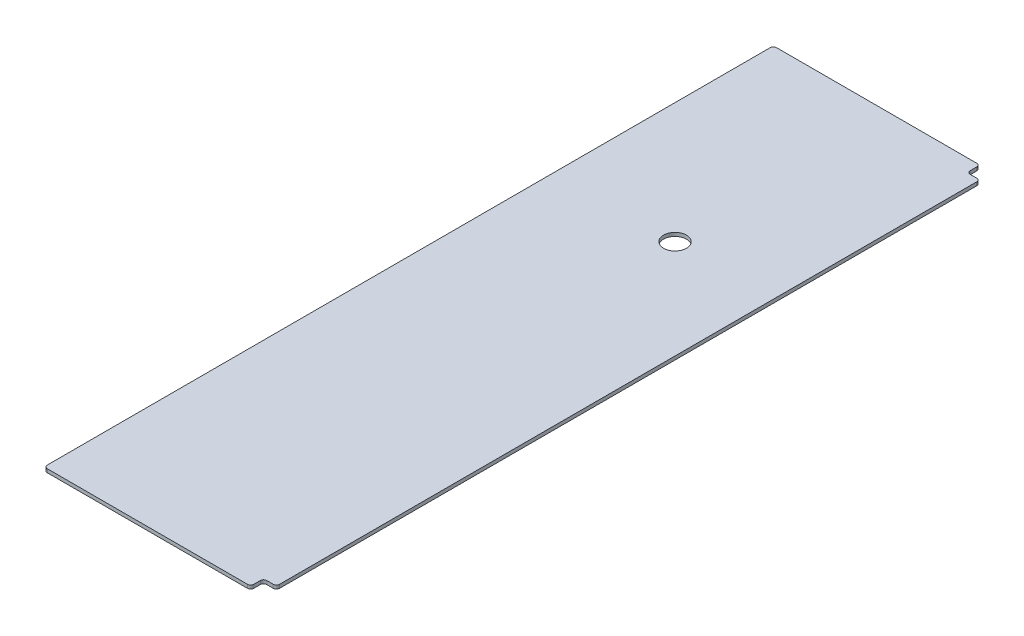
ISO-10303-21;
HEADER;
FILE_DESCRIPTION(('STEP AP214'),'2;1');
FILE_NAME('part.step','',(''),(''),'','','');
FILE_SCHEMA(('AUTOMOTIVE_DESIGN { 1 0 10303 214 1 1 1 1 }'));
ENDSEC;
DATA;
#1=APPLICATION_CONTEXT('core data for automotive mechanical design processes');
#2=APPLICATION_PROTOCOL_DEFINITION('international standard','automotive_design',2000,#1);
#3=PRODUCT_CONTEXT('',#1,'mechanical');
#4=PRODUCT('Part','Part','',(#3));
#5=PRODUCT_RELATED_PRODUCT_CATEGORY('part','',(#4));
#6=PRODUCT_DEFINITION_FORMATION('','',#4);
#7=PRODUCT_DEFINITION_CONTEXT('part definition',#1,'design');
#8=PRODUCT_DEFINITION('design','',#6,#7);
#9=PRODUCT_DEFINITION_SHAPE('','',#8);
#10=(LENGTH_UNIT() NAMED_UNIT(*) SI_UNIT(.MILLI.,.METRE.));
#11=(NAMED_UNIT(*) PLANE_ANGLE_UNIT() SI_UNIT($,.RADIAN.));
#12=(NAMED_UNIT(*) SI_UNIT($,.STERADIAN.) SOLID_ANGLE_UNIT());
#13=UNCERTAINTY_MEASURE_WITH_UNIT(LENGTH_MEASURE(1.E-05),#10,'distance_accuracy_value','');
#14=(GEOMETRIC_REPRESENTATION_CONTEXT(3) GLOBAL_UNCERTAINTY_ASSIGNED_CONTEXT((#13)) GLOBAL_UNIT_ASSIGNED_CONTEXT((#10,
#11,#12)) REPRESENTATION_CONTEXT('',''));
#15=CARTESIAN_POINT('',(0.,0.,0.));
#16=DIRECTION('',(0.,0.,1.));
#17=DIRECTION('',(1.,0.,0.));
#18=AXIS2_PLACEMENT_3D('',#15,#16,#17);
#19=CARTESIAN_POINT('',(190.5,2.778125,0.));
#20=DIRECTION('',(-1.,0.,0.));
#21=DIRECTION('',(0.,0.,1.));
#22=AXIS2_PLACEMENT_3D('',#19,#20,#21);
#23=PLANE('',#22);
#24=DIRECTION('',(0.,0.,-1.));
#25=VECTOR('',#24,1.);
#26=CARTESIAN_POINT('',(190.5,2.778125,0.));
#27=LINE('',#26,#25);
#28=CARTESIAN_POINT('',(190.5,2.778125,-30.48));
#29=VERTEX_POINT('',#28);
#30=CARTESIAN_POINT('',(190.5,2.778125,-579.12));
#31=VERTEX_POINT('',#30);
#32=EDGE_CURVE('E182',#29,#31,#27,.T.);
#33=ORIENTED_EDGE('',*,*,#32,.F.);
#34=DIRECTION('',(0.,1.,0.));
#35=VECTOR('',#34,1.);
#36=CARTESIAN_POINT('',(190.5,2.778125,-30.48));
#37=LINE('',#36,#35);
#38=CARTESIAN_POINT('',(190.5,0.,-30.48));
#39=VERTEX_POINT('',#38);
#40=EDGE_CURVE('E238',#29,#39,#37,.F.);
#41=ORIENTED_EDGE('',*,*,#40,.T.);
#42=DIRECTION('',(0.,0.,-1.));
#43=VECTOR('',#42,1.);
#44=CARTESIAN_POINT('',(190.5,0.,0.));
#45=LINE('',#44,#43);
#46=CARTESIAN_POINT('',(190.5,0.,-579.12));
#47=VERTEX_POINT('',#46);
#48=EDGE_CURVE('E185',#39,#47,#45,.T.);
#49=ORIENTED_EDGE('',*,*,#48,.T.);
#50=DIRECTION('',(0.,1.,0.));
#51=VECTOR('',#50,1.);
#52=CARTESIAN_POINT('',(190.5,2.778125,-579.12));
#53=LINE('',#52,#51);
#54=EDGE_CURVE('E235',#47,#31,#53,.T.);
#55=ORIENTED_EDGE('',*,*,#54,.T.);
#56=EDGE_LOOP('',(#33,#41,#49,#55));
#57=FACE_BOUND('',#56,.T.);
#58=ADVANCED_FACE('F33',(#57),#23,.F.);
#59=CARTESIAN_POINT('',(0.,2.778125,0.));
#60=DIRECTION('',(0.,-1.,0.));
#61=DIRECTION('',(0.,0.,-1.));
#62=AXIS2_PLACEMENT_3D('',#59,#60,#61);
#63=PLANE('',#62);
#64=CARTESIAN_POINT('',(112.580000000002,2.778125,-419.599999966549));
#65=DIRECTION('',(0.,-1.,0.));
#66=DIRECTION('',(0.,0.,-1.));
#67=AXIS2_PLACEMENT_3D('',#64,#65,#66);
#68=CIRCLE('',#67,9.00000000000002);
#69=CARTESIAN_POINT('',(112.580000000002,2.778125,-428.599999966549));
#70=VERTEX_POINT('',#69);
#71=EDGE_CURVE('E279',#70,#70,#68,.T.);
#72=ORIENTED_EDGE('',*,*,#71,.T.);
#73=EDGE_LOOP('',(#72));
#74=FACE_BOUND('',#73,.T.);
#75=DIRECTION('',(1.,0.,0.));
#76=VECTOR('',#75,1.);
#77=CARTESIAN_POINT('',(0.,2.778125,-591.82));
#78=LINE('',#77,#76);
#79=CARTESIAN_POINT('',(20.32,2.778125,-591.82));
#80=VERTEX_POINT('',#79);
#81=CARTESIAN_POINT('',(177.8,2.778125,-591.82));
#82=VERTEX_POINT('',#81);
#83=EDGE_CURVE('E164',#80,#82,#78,.T.);
#84=ORIENTED_EDGE('',*,*,#83,.F.);
#85=CARTESIAN_POINT('',(20.32,2.778125,-589.28));
#86=DIRECTION('',(0.,-1.,0.));
#87=DIRECTION('',(0.,0.,-1.));
#88=AXIS2_PLACEMENT_3D('',#85,#86,#87);
#89=CIRCLE('',#88,2.54);
#90=CARTESIAN_POINT('',(17.78,2.778125,-589.28));
#91=VERTEX_POINT('',#90);
#92=EDGE_CURVE('E147',#80,#91,#89,.F.);
#93=ORIENTED_EDGE('',*,*,#92,.T.);
#94=DIRECTION('',(0.,0.,-1.));
#95=VECTOR('',#94,1.);
#96=CARTESIAN_POINT('',(17.78,2.778125,-591.82));
#97=LINE('',#96,#95);
#98=CARTESIAN_POINT('',(17.78,2.778125,-20.32));
#99=VERTEX_POINT('',#98);
#100=EDGE_CURVE('E178',#99,#91,#97,.T.);
#101=ORIENTED_EDGE('',*,*,#100,.F.);
#102=CARTESIAN_POINT('',(20.32,2.778125,-20.32));
#103=DIRECTION('',(0.,-1.,0.));
#104=DIRECTION('',(0.,0.,-1.));
#105=AXIS2_PLACEMENT_3D('',#102,#103,#104);
#106=CIRCLE('',#105,2.54);
#107=CARTESIAN_POINT('',(20.32,2.778125,-17.78));
#108=VERTEX_POINT('',#107);
#109=EDGE_CURVE('E158',#99,#108,#106,.F.);
#110=ORIENTED_EDGE('',*,*,#109,.T.);
#111=DIRECTION('',(-1.,0.,0.));
#112=VECTOR('',#111,1.);
#113=CARTESIAN_POINT('',(0.,2.778125,-17.78));
#114=LINE('',#113,#112);
#115=CARTESIAN_POINT('',(177.8,2.778125,-17.78));
#116=VERTEX_POINT('',#115);
#117=EDGE_CURVE('E175',#116,#108,#114,.T.);
#118=ORIENTED_EDGE('',*,*,#117,.F.);
#119=CARTESIAN_POINT('',(177.8,2.778125,-20.32));
#120=DIRECTION('',(0.,-1.,0.));
#121=DIRECTION('',(0.,0.,-1.));
#122=AXIS2_PLACEMENT_3D('',#119,#120,#121);
#123=CIRCLE('',#122,2.54);
#124=CARTESIAN_POINT('',(180.34,2.778125,-20.32));
#125=VERTEX_POINT('',#124);
#126=EDGE_CURVE('E192',#116,#125,#123,.F.);
#127=ORIENTED_EDGE('',*,*,#126,.T.);
#128=DIRECTION('',(0.,0.,1.));
#129=VECTOR('',#128,1.);
#130=CARTESIAN_POINT('',(180.34,2.778125,-17.78));
#131=LINE('',#130,#129);
#132=CARTESIAN_POINT('',(180.34,2.778125,-25.4));
#133=VERTEX_POINT('',#132);
#134=EDGE_CURVE('E273',#133,#125,#131,.T.);
#135=ORIENTED_EDGE('',*,*,#134,.F.);
#136=CARTESIAN_POINT('',(182.88,2.778125,-25.4));
#137=DIRECTION('',(0.,-1.,0.));
#138=DIRECTION('',(0.,0.,-1.));
#139=AXIS2_PLACEMENT_3D('',#136,#137,#138);
#140=CIRCLE('',#139,2.54);
#141=CARTESIAN_POINT('',(182.88,2.778125,-27.94));
#142=VERTEX_POINT('',#141);
#143=EDGE_CURVE('E240',#133,#142,#140,.T.);
#144=ORIENTED_EDGE('',*,*,#143,.T.);
#145=DIRECTION('',(-1.,0.,0.));
#146=VECTOR('',#145,1.);
#147=CARTESIAN_POINT('',(190.5,2.778125,-27.94));
#148=LINE('',#147,#146);
#149=CARTESIAN_POINT('',(187.96,2.778125,-27.94));
#150=VERTEX_POINT('',#149);
#151=EDGE_CURVE('E276',#150,#142,#148,.T.);
#152=ORIENTED_EDGE('',*,*,#151,.F.);
#153=CARTESIAN_POINT('',(187.96,2.778125,-30.48));
#154=DIRECTION('',(0.,-1.,0.));
#155=DIRECTION('',(0.,0.,-1.));
#156=AXIS2_PLACEMENT_3D('',#153,#154,#155);
#157=CIRCLE('',#156,2.54);
#158=EDGE_CURVE('E194',#150,#29,#157,.F.);
#159=ORIENTED_EDGE('',*,*,#158,.T.);
#160=ORIENTED_EDGE('',*,*,#32,.T.);
#161=CARTESIAN_POINT('',(187.96,2.778125,-579.12));
#162=DIRECTION('',(0.,-1.,0.));
#163=DIRECTION('',(0.,0.,-1.));
#164=AXIS2_PLACEMENT_3D('',#161,#162,#163);
#165=CIRCLE('',#164,2.54);
#166=CARTESIAN_POINT('',(187.96,2.778125,-581.66));
#167=VERTEX_POINT('',#166);
#168=EDGE_CURVE('E167',#31,#167,#165,.F.);
#169=ORIENTED_EDGE('',*,*,#168,.T.);
#170=DIRECTION('',(1.,0.,0.));
#171=VECTOR('',#170,1.);
#172=CARTESIAN_POINT('',(190.5,2.778125,-581.66));
#173=LINE('',#172,#171);
#174=CARTESIAN_POINT('',(182.88,2.778125,-581.66));
#175=VERTEX_POINT('',#174);
#176=EDGE_CURVE('E246',#175,#167,#173,.T.);
#177=ORIENTED_EDGE('',*,*,#176,.F.);
#178=CARTESIAN_POINT('',(182.88,2.778125,-584.2));
#179=DIRECTION('',(0.,-1.,0.));
#180=DIRECTION('',(0.,0.,-1.));
#181=AXIS2_PLACEMENT_3D('',#178,#179,#180);
#182=CIRCLE('',#181,2.54);
#183=CARTESIAN_POINT('',(180.34,2.778125,-584.2));
#184=VERTEX_POINT('',#183);
#185=EDGE_CURVE('E41',#175,#184,#182,.T.);
#186=ORIENTED_EDGE('',*,*,#185,.T.);
#187=DIRECTION('',(0.,0.,1.));
#188=VECTOR('',#187,1.);
#189=CARTESIAN_POINT('',(180.34,2.778125,-591.82));
#190=LINE('',#189,#188);
#191=CARTESIAN_POINT('',(180.34,2.778125,-589.28));
#192=VERTEX_POINT('',#191);
#193=EDGE_CURVE('E244',#192,#184,#190,.T.);
#194=ORIENTED_EDGE('',*,*,#193,.F.);
#195=CARTESIAN_POINT('',(177.8,2.778125,-589.28));
#196=DIRECTION('',(0.,-1.,0.));
#197=DIRECTION('',(0.,0.,-1.));
#198=AXIS2_PLACEMENT_3D('',#195,#196,#197);
#199=CIRCLE('',#198,2.54);
#200=EDGE_CURVE('E172',#192,#82,#199,.F.);
#201=ORIENTED_EDGE('',*,*,#200,.T.);
#202=EDGE_LOOP('',(#84,#93,#101,#110,#118,#127,#135,#144,#152,#159,#160,#169,#177,#186,#194,#201));
#203=FACE_BOUND('',#202,.T.);
#204=ADVANCED_FACE('F170',(#74,#203),#63,.F.);
#205=CARTESIAN_POINT('',(0.,0.,0.));
#206=DIRECTION('',(0.,-1.,0.));
#207=DIRECTION('',(0.,0.,-1.));
#208=AXIS2_PLACEMENT_3D('',#205,#206,#207);
#209=PLANE('',#208);
#210=CARTESIAN_POINT('',(112.580000000002,0.,-419.599999966549));
#211=DIRECTION('',(0.,-1.,0.));
#212=DIRECTION('',(0.,0.,-1.));
#213=AXIS2_PLACEMENT_3D('',#210,#211,#212);
#214=CIRCLE('',#213,9.00000000000002);
#215=CARTESIAN_POINT('',(112.580000000002,0.,-428.599999966549));
#216=VERTEX_POINT('',#215);
#217=EDGE_CURVE('E482',#216,#216,#214,.T.);
#218=ORIENTED_EDGE('',*,*,#217,.F.);
#219=EDGE_LOOP('',(#218));
#220=FACE_BOUND('',#219,.T.);
#221=DIRECTION('',(0.,0.,-1.));
#222=VECTOR('',#221,1.);
#223=CARTESIAN_POINT('',(17.78,0.,-591.82));
#224=LINE('',#223,#222);
#225=CARTESIAN_POINT('',(17.78,0.,-20.32));
#226=VERTEX_POINT('',#225);
#227=CARTESIAN_POINT('',(17.78,0.,-589.28));
#228=VERTEX_POINT('',#227);
#229=EDGE_CURVE('E173',#226,#228,#224,.T.);
#230=ORIENTED_EDGE('',*,*,#229,.T.);
#231=CARTESIAN_POINT('',(20.32,0.,-589.28));
#232=DIRECTION('',(0.,-1.,0.));
#233=DIRECTION('',(0.,0.,-1.));
#234=AXIS2_PLACEMENT_3D('',#231,#232,#233);
#235=CIRCLE('',#234,2.54);
#236=CARTESIAN_POINT('',(20.32,0.,-591.82));
#237=VERTEX_POINT('',#236);
#238=EDGE_CURVE('E209',#228,#237,#235,.T.);
#239=ORIENTED_EDGE('',*,*,#238,.T.);
#240=DIRECTION('',(1.,0.,0.));
#241=VECTOR('',#240,1.);
#242=CARTESIAN_POINT('',(0.,0.,-591.82));
#243=LINE('',#242,#241);
#244=CARTESIAN_POINT('',(177.8,0.,-591.82));
#245=VERTEX_POINT('',#244);
#246=EDGE_CURVE('E166',#237,#245,#243,.T.);
#247=ORIENTED_EDGE('',*,*,#246,.T.);
#248=CARTESIAN_POINT('',(177.8,0.,-589.28));
#249=DIRECTION('',(0.,-1.,0.));
#250=DIRECTION('',(0.,0.,-1.));
#251=AXIS2_PLACEMENT_3D('',#248,#249,#250);
#252=CIRCLE('',#251,2.54);
#253=CARTESIAN_POINT('',(180.34,0.,-589.28));
#254=VERTEX_POINT('',#253);
#255=EDGE_CURVE('E55',#245,#254,#252,.T.);
#256=ORIENTED_EDGE('',*,*,#255,.T.);
#257=DIRECTION('',(0.,0.,1.));
#258=VECTOR('',#257,1.);
#259=CARTESIAN_POINT('',(180.34,0.,-591.82));
#260=LINE('',#259,#258);
#261=CARTESIAN_POINT('',(180.34,0.,-584.2));
#262=VERTEX_POINT('',#261);
#263=EDGE_CURVE('E260',#254,#262,#260,.T.);
#264=ORIENTED_EDGE('',*,*,#263,.T.);
#265=CARTESIAN_POINT('',(182.88,0.,-584.2));
#266=DIRECTION('',(0.,-1.,0.));
#267=DIRECTION('',(0.,0.,-1.));
#268=AXIS2_PLACEMENT_3D('',#265,#266,#267);
#269=CIRCLE('',#268,2.54);
#270=CARTESIAN_POINT('',(182.88,0.,-581.66));
#271=VERTEX_POINT('',#270);
#272=EDGE_CURVE('E11',#262,#271,#269,.F.);
#273=ORIENTED_EDGE('',*,*,#272,.T.);
#274=DIRECTION('',(1.,0.,0.));
#275=VECTOR('',#274,1.);
#276=CARTESIAN_POINT('',(190.5,0.,-581.66));
#277=LINE('',#276,#275);
#278=CARTESIAN_POINT('',(187.96,0.,-581.66));
#279=VERTEX_POINT('',#278);
#280=EDGE_CURVE('E258',#271,#279,#277,.T.);
#281=ORIENTED_EDGE('',*,*,#280,.T.);
#282=CARTESIAN_POINT('',(187.96,0.,-579.12));
#283=DIRECTION('',(0.,-1.,0.));
#284=DIRECTION('',(0.,0.,-1.));
#285=AXIS2_PLACEMENT_3D('',#282,#283,#284);
#286=CIRCLE('',#285,2.54);
#287=EDGE_CURVE('E200',#279,#47,#286,.T.);
#288=ORIENTED_EDGE('',*,*,#287,.T.);
#289=ORIENTED_EDGE('',*,*,#48,.F.);
#290=CARTESIAN_POINT('',(187.96,0.,-30.48));
#291=DIRECTION('',(0.,-1.,0.));
#292=DIRECTION('',(0.,0.,-1.));
#293=AXIS2_PLACEMENT_3D('',#290,#291,#292);
#294=CIRCLE('',#293,2.54);
#295=CARTESIAN_POINT('',(187.96,0.,-27.94));
#296=VERTEX_POINT('',#295);
#297=EDGE_CURVE('E205',#39,#296,#294,.T.);
#298=ORIENTED_EDGE('',*,*,#297,.T.);
#299=DIRECTION('',(-1.,0.,0.));
#300=VECTOR('',#299,1.);
#301=CARTESIAN_POINT('',(190.5,0.,-27.94));
#302=LINE('',#301,#300);
#303=CARTESIAN_POINT('',(182.88,0.,-27.94));
#304=VERTEX_POINT('',#303);
#305=EDGE_CURVE('E270',#296,#304,#302,.T.);
#306=ORIENTED_EDGE('',*,*,#305,.T.);
#307=CARTESIAN_POINT('',(182.88,0.,-25.4));
#308=DIRECTION('',(0.,-1.,0.));
#309=DIRECTION('',(0.,0.,-1.));
#310=AXIS2_PLACEMENT_3D('',#307,#308,#309);
#311=CIRCLE('',#310,2.54);
#312=CARTESIAN_POINT('',(180.34,0.,-25.4));
#313=VERTEX_POINT('',#312);
#314=EDGE_CURVE('E242',#304,#313,#311,.F.);
#315=ORIENTED_EDGE('',*,*,#314,.T.);
#316=DIRECTION('',(0.,0.,1.));
#317=VECTOR('',#316,1.);
#318=CARTESIAN_POINT('',(180.34,0.,-17.78));
#319=LINE('',#318,#317);
#320=CARTESIAN_POINT('',(180.34,0.,-20.32));
#321=VERTEX_POINT('',#320);
#322=EDGE_CURVE('E251',#313,#321,#319,.T.);
#323=ORIENTED_EDGE('',*,*,#322,.T.);
#324=CARTESIAN_POINT('',(177.8,0.,-20.32));
#325=DIRECTION('',(0.,-1.,0.));
#326=DIRECTION('',(0.,0.,-1.));
#327=AXIS2_PLACEMENT_3D('',#324,#325,#326);
#328=CIRCLE('',#327,2.54);
#329=CARTESIAN_POINT('',(177.8,0.,-17.78));
#330=VERTEX_POINT('',#329);
#331=EDGE_CURVE('E203',#321,#330,#328,.T.);
#332=ORIENTED_EDGE('',*,*,#331,.T.);
#333=DIRECTION('',(-1.,0.,0.));
#334=VECTOR('',#333,1.);
#335=CARTESIAN_POINT('',(0.,0.,-17.78));
#336=LINE('',#335,#334);
#337=CARTESIAN_POINT('',(20.32,0.,-17.78));
#338=VERTEX_POINT('',#337);
#339=EDGE_CURVE('E188',#330,#338,#336,.T.);
#340=ORIENTED_EDGE('',*,*,#339,.T.);
#341=CARTESIAN_POINT('',(20.32,0.,-20.32));
#342=DIRECTION('',(0.,-1.,0.));
#343=DIRECTION('',(0.,0.,-1.));
#344=AXIS2_PLACEMENT_3D('',#341,#342,#343);
#345=CIRCLE('',#344,2.54);
#346=EDGE_CURVE('E207',#338,#226,#345,.T.);
#347=ORIENTED_EDGE('',*,*,#346,.T.);
#348=EDGE_LOOP('',(#230,#239,#247,#256,#264,#273,#281,#288,#289,#298,#306,#315,#323,#332,#340,#347));
#349=FACE_BOUND('',#348,.T.);
#350=ADVANCED_FACE('F257',(#220,#349),#209,.T.);
#351=CARTESIAN_POINT('',(0.,0.,-591.82));
#352=DIRECTION('',(0.,0.,1.));
#353=DIRECTION('',(1.,0.,0.));
#354=AXIS2_PLACEMENT_3D('',#351,#352,#353);
#355=PLANE('',#354);
#356=ORIENTED_EDGE('',*,*,#246,.F.);
#357=DIRECTION('',(0.,1.,0.));
#358=VECTOR('',#357,1.);
#359=CARTESIAN_POINT('',(20.32,0.,-591.82));
#360=LINE('',#359,#358);
#361=EDGE_CURVE('E151',#237,#80,#360,.T.);
#362=ORIENTED_EDGE('',*,*,#361,.T.);
#363=ORIENTED_EDGE('',*,*,#83,.T.);
#364=DIRECTION('',(0.,1.,0.));
#365=VECTOR('',#364,1.);
#366=CARTESIAN_POINT('',(177.8,0.,-591.82));
#367=LINE('',#366,#365);
#368=EDGE_CURVE('E168',#82,#245,#367,.F.);
#369=ORIENTED_EDGE('',*,*,#368,.T.);
#370=EDGE_LOOP('',(#356,#362,#363,#369));
#371=FACE_BOUND('',#370,.T.);
#372=ADVANCED_FACE('F163',(#371),#355,.F.);
#373=CARTESIAN_POINT('',(0.,0.,-17.78));
#374=DIRECTION('',(0.,0.,-1.));
#375=DIRECTION('',(-1.,0.,0.));
#376=AXIS2_PLACEMENT_3D('',#373,#374,#375);
#377=PLANE('',#376);
#378=ORIENTED_EDGE('',*,*,#117,.T.);
#379=DIRECTION('',(0.,1.,0.));
#380=VECTOR('',#379,1.);
#381=CARTESIAN_POINT('',(20.32,0.,-17.78));
#382=LINE('',#381,#380);
#383=EDGE_CURVE('E214',#108,#338,#382,.F.);
#384=ORIENTED_EDGE('',*,*,#383,.T.);
#385=ORIENTED_EDGE('',*,*,#339,.F.);
#386=DIRECTION('',(0.,1.,0.));
#387=VECTOR('',#386,1.);
#388=CARTESIAN_POINT('',(177.8,0.,-17.78));
#389=LINE('',#388,#387);
#390=EDGE_CURVE('E211',#330,#116,#389,.T.);
#391=ORIENTED_EDGE('',*,*,#390,.T.);
#392=EDGE_LOOP('',(#378,#384,#385,#391));
#393=FACE_BOUND('',#392,.T.);
#394=ADVANCED_FACE('F287',(#393),#377,.F.);
#395=CARTESIAN_POINT('',(17.78,0.,-591.82));
#396=DIRECTION('',(1.,0.,0.));
#397=DIRECTION('',(0.,0.,-1.));
#398=AXIS2_PLACEMENT_3D('',#395,#396,#397);
#399=PLANE('',#398);
#400=ORIENTED_EDGE('',*,*,#100,.T.);
#401=DIRECTION('',(0.,1.,0.));
#402=VECTOR('',#401,1.);
#403=CARTESIAN_POINT('',(17.78,0.,-589.28));
#404=LINE('',#403,#402);
#405=EDGE_CURVE('E152',#91,#228,#404,.F.);
#406=ORIENTED_EDGE('',*,*,#405,.T.);
#407=ORIENTED_EDGE('',*,*,#229,.F.);
#408=DIRECTION('',(0.,1.,0.));
#409=VECTOR('',#408,1.);
#410=CARTESIAN_POINT('',(17.78,0.,-20.32));
#411=LINE('',#410,#409);
#412=EDGE_CURVE('E157',#226,#99,#411,.T.);
#413=ORIENTED_EDGE('',*,*,#412,.T.);
#414=EDGE_LOOP('',(#400,#406,#407,#413));
#415=FACE_BOUND('',#414,.T.);
#416=ADVANCED_FACE('F296',(#415),#399,.F.);
#417=CARTESIAN_POINT('',(180.34,0.,-17.78));
#418=DIRECTION('',(-1.,0.,0.));
#419=DIRECTION('',(0.,0.,1.));
#420=AXIS2_PLACEMENT_3D('',#417,#418,#419);
#421=PLANE('',#420);
#422=ORIENTED_EDGE('',*,*,#322,.F.);
#423=DIRECTION('',(0.,1.,0.));
#424=VECTOR('',#423,1.);
#425=CARTESIAN_POINT('',(180.34,2.778125,-25.4));
#426=LINE('',#425,#424);
#427=EDGE_CURVE('E218',#313,#133,#426,.T.);
#428=ORIENTED_EDGE('',*,*,#427,.T.);
#429=ORIENTED_EDGE('',*,*,#134,.T.);
#430=DIRECTION('',(0.,1.,0.));
#431=VECTOR('',#430,1.);
#432=CARTESIAN_POINT('',(180.34,0.,-20.32));
#433=LINE('',#432,#431);
#434=EDGE_CURVE('E216',#125,#321,#433,.F.);
#435=ORIENTED_EDGE('',*,*,#434,.T.);
#436=EDGE_LOOP('',(#422,#428,#429,#435));
#437=FACE_BOUND('',#436,.T.);
#438=ADVANCED_FACE('F298',(#437),#421,.F.);
#439=CARTESIAN_POINT('',(190.5,0.,-27.94));
#440=DIRECTION('',(0.,0.,-1.));
#441=DIRECTION('',(-1.,0.,0.));
#442=AXIS2_PLACEMENT_3D('',#439,#440,#441);
#443=PLANE('',#442);
#444=ORIENTED_EDGE('',*,*,#151,.T.);
#445=DIRECTION('',(0.,1.,0.));
#446=VECTOR('',#445,1.);
#447=CARTESIAN_POINT('',(182.88,0.,-27.94));
#448=LINE('',#447,#446);
#449=EDGE_CURVE('E224',#142,#304,#448,.F.);
#450=ORIENTED_EDGE('',*,*,#449,.T.);
#451=ORIENTED_EDGE('',*,*,#305,.F.);
#452=DIRECTION('',(0.,1.,0.));
#453=VECTOR('',#452,1.);
#454=CARTESIAN_POINT('',(187.96,0.,-27.94));
#455=LINE('',#454,#453);
#456=EDGE_CURVE('E221',#296,#150,#455,.T.);
#457=ORIENTED_EDGE('',*,*,#456,.T.);
#458=EDGE_LOOP('',(#444,#450,#451,#457));
#459=FACE_BOUND('',#458,.T.);
#460=ADVANCED_FACE('F304',(#459),#443,.F.);
#461=CARTESIAN_POINT('',(190.5,0.,-581.66));
#462=DIRECTION('',(0.,0.,1.));
#463=DIRECTION('',(1.,0.,0.));
#464=AXIS2_PLACEMENT_3D('',#461,#462,#463);
#465=PLANE('',#464);
#466=ORIENTED_EDGE('',*,*,#280,.F.);
#467=DIRECTION('',(0.,1.,0.));
#468=VECTOR('',#467,1.);
#469=CARTESIAN_POINT('',(182.88,2.778125,-581.66));
#470=LINE('',#469,#468);
#471=EDGE_CURVE('E228',#271,#175,#470,.T.);
#472=ORIENTED_EDGE('',*,*,#471,.T.);
#473=ORIENTED_EDGE('',*,*,#176,.T.);
#474=DIRECTION('',(0.,1.,0.));
#475=VECTOR('',#474,1.);
#476=CARTESIAN_POINT('',(187.96,0.,-581.66));
#477=LINE('',#476,#475);
#478=EDGE_CURVE('E226',#167,#279,#477,.F.);
#479=ORIENTED_EDGE('',*,*,#478,.T.);
#480=EDGE_LOOP('',(#466,#472,#473,#479));
#481=FACE_BOUND('',#480,.T.);
#482=ADVANCED_FACE('F262',(#481),#465,.F.);
#483=CARTESIAN_POINT('',(180.34,0.,-591.82));
#484=DIRECTION('',(-1.,0.,0.));
#485=DIRECTION('',(0.,0.,1.));
#486=AXIS2_PLACEMENT_3D('',#483,#484,#485);
#487=PLANE('',#486);
#488=ORIENTED_EDGE('',*,*,#193,.T.);
#489=DIRECTION('',(0.,1.,0.));
#490=VECTOR('',#489,1.);
#491=CARTESIAN_POINT('',(180.34,0.,-584.2));
#492=LINE('',#491,#490);
#493=EDGE_CURVE('E48',#184,#262,#492,.F.);
#494=ORIENTED_EDGE('',*,*,#493,.T.);
#495=ORIENTED_EDGE('',*,*,#263,.F.);
#496=DIRECTION('',(0.,1.,0.));
#497=VECTOR('',#496,1.);
#498=CARTESIAN_POINT('',(180.34,0.,-589.28));
#499=LINE('',#498,#497);
#500=EDGE_CURVE('E231',#254,#192,#499,.T.);
#501=ORIENTED_EDGE('',*,*,#500,.T.);
#502=EDGE_LOOP('',(#488,#494,#495,#501));
#503=FACE_BOUND('',#502,.T.);
#504=ADVANCED_FACE('F249',(#503),#487,.F.);
#505=CARTESIAN_POINT('',(20.32,0.,-589.28));
#506=DIRECTION('',(0.,1.,0.));
#507=DIRECTION('',(0.,0.,1.));
#508=AXIS2_PLACEMENT_3D('',#505,#506,#507);
#509=CYLINDRICAL_SURFACE('',#508,2.54);
#510=ORIENTED_EDGE('',*,*,#238,.F.);
#511=ORIENTED_EDGE('',*,*,#405,.F.);
#512=ORIENTED_EDGE('',*,*,#92,.F.);
#513=ORIENTED_EDGE('',*,*,#361,.F.);
#514=EDGE_LOOP('',(#510,#511,#512,#513));
#515=FACE_BOUND('',#514,.T.);
#516=ADVANCED_FACE('F150',(#515),#509,.T.);
#517=CARTESIAN_POINT('',(20.32,0.,-20.32));
#518=DIRECTION('',(0.,1.,0.));
#519=DIRECTION('',(0.,0.,1.));
#520=AXIS2_PLACEMENT_3D('',#517,#518,#519);
#521=CYLINDRICAL_SURFACE('',#520,2.54);
#522=ORIENTED_EDGE('',*,*,#346,.F.);
#523=ORIENTED_EDGE('',*,*,#383,.F.);
#524=ORIENTED_EDGE('',*,*,#109,.F.);
#525=ORIENTED_EDGE('',*,*,#412,.F.);
#526=EDGE_LOOP('',(#522,#523,#524,#525));
#527=FACE_BOUND('',#526,.T.);
#528=ADVANCED_FACE('F292',(#527),#521,.T.);
#529=CARTESIAN_POINT('',(182.88,0.,-25.4));
#530=DIRECTION('',(0.,-1.,0.));
#531=DIRECTION('',(0.,0.,-1.));
#532=AXIS2_PLACEMENT_3D('',#529,#530,#531);
#533=CYLINDRICAL_SURFACE('',#532,2.54);
#534=ORIENTED_EDGE('',*,*,#314,.F.);
#535=ORIENTED_EDGE('',*,*,#449,.F.);
#536=ORIENTED_EDGE('',*,*,#143,.F.);
#537=ORIENTED_EDGE('',*,*,#427,.F.);
#538=EDGE_LOOP('',(#534,#535,#536,#537));
#539=FACE_BOUND('',#538,.T.);
#540=ADVANCED_FACE('F325',(#539),#533,.F.);
#541=CARTESIAN_POINT('',(182.88,0.,-584.2));
#542=DIRECTION('',(0.,-1.,0.));
#543=DIRECTION('',(0.,0.,-1.));
#544=AXIS2_PLACEMENT_3D('',#541,#542,#543);
#545=CYLINDRICAL_SURFACE('',#544,2.54);
#546=ORIENTED_EDGE('',*,*,#272,.F.);
#547=ORIENTED_EDGE('',*,*,#493,.F.);
#548=ORIENTED_EDGE('',*,*,#185,.F.);
#549=ORIENTED_EDGE('',*,*,#471,.F.);
#550=EDGE_LOOP('',(#546,#547,#548,#549));
#551=FACE_BOUND('',#550,.T.);
#552=ADVANCED_FACE('F254',(#551),#545,.F.);
#553=CARTESIAN_POINT('',(187.96,0.,-30.48));
#554=DIRECTION('',(0.,1.,0.));
#555=DIRECTION('',(0.,0.,1.));
#556=AXIS2_PLACEMENT_3D('',#553,#554,#555);
#557=CYLINDRICAL_SURFACE('',#556,2.54);
#558=ORIENTED_EDGE('',*,*,#297,.F.);
#559=ORIENTED_EDGE('',*,*,#40,.F.);
#560=ORIENTED_EDGE('',*,*,#158,.F.);
#561=ORIENTED_EDGE('',*,*,#456,.F.);
#562=EDGE_LOOP('',(#558,#559,#560,#561));
#563=FACE_BOUND('',#562,.T.);
#564=ADVANCED_FACE('F331',(#563),#557,.T.);
#565=CARTESIAN_POINT('',(177.8,0.,-20.32));
#566=DIRECTION('',(0.,1.,0.));
#567=DIRECTION('',(0.,0.,1.));
#568=AXIS2_PLACEMENT_3D('',#565,#566,#567);
#569=CYLINDRICAL_SURFACE('',#568,2.54);
#570=ORIENTED_EDGE('',*,*,#331,.F.);
#571=ORIENTED_EDGE('',*,*,#434,.F.);
#572=ORIENTED_EDGE('',*,*,#126,.F.);
#573=ORIENTED_EDGE('',*,*,#390,.F.);
#574=EDGE_LOOP('',(#570,#571,#572,#573));
#575=FACE_BOUND('',#574,.T.);
#576=ADVANCED_FACE('F334',(#575),#569,.T.);
#577=CARTESIAN_POINT('',(177.8,0.,-589.28));
#578=DIRECTION('',(0.,1.,0.));
#579=DIRECTION('',(0.,0.,1.));
#580=AXIS2_PLACEMENT_3D('',#577,#578,#579);
#581=CYLINDRICAL_SURFACE('',#580,2.54);
#582=ORIENTED_EDGE('',*,*,#255,.F.);
#583=ORIENTED_EDGE('',*,*,#368,.F.);
#584=ORIENTED_EDGE('',*,*,#200,.F.);
#585=ORIENTED_EDGE('',*,*,#500,.F.);
#586=EDGE_LOOP('',(#582,#583,#584,#585));
#587=FACE_BOUND('',#586,.T.);
#588=ADVANCED_FACE('F337',(#587),#581,.T.);
#589=CARTESIAN_POINT('',(187.96,2.778125,-579.12));
#590=DIRECTION('',(0.,1.,0.));
#591=DIRECTION('',(0.,0.,1.));
#592=AXIS2_PLACEMENT_3D('',#589,#590,#591);
#593=CYLINDRICAL_SURFACE('',#592,2.54);
#594=ORIENTED_EDGE('',*,*,#287,.F.);
#595=ORIENTED_EDGE('',*,*,#478,.F.);
#596=ORIENTED_EDGE('',*,*,#168,.F.);
#597=ORIENTED_EDGE('',*,*,#54,.F.);
#598=EDGE_LOOP('',(#594,#595,#596,#597));
#599=FACE_BOUND('',#598,.T.);
#600=ADVANCED_FACE('F35',(#599),#593,.T.);
#601=CARTESIAN_POINT('',(112.580000000002,2.778125,-419.599999966549));
#602=DIRECTION('',(0.,-1.,0.));
#603=DIRECTION('',(0.,0.,-1.));
#604=AXIS2_PLACEMENT_3D('',#601,#602,#603);
#605=CYLINDRICAL_SURFACE('',#604,9.00000000000002);
#606=ORIENTED_EDGE('',*,*,#71,.F.);
#607=EDGE_LOOP('',(#606));
#608=FACE_BOUND('',#607,.T.);
#609=ORIENTED_EDGE('',*,*,#217,.T.);
#610=EDGE_LOOP('',(#609));
#611=FACE_BOUND('',#610,.T.);
#612=ADVANCED_FACE('F344',(#608,#611),#605,.F.);
#613=CLOSED_SHELL('',(#58,#204,#350,#372,#394,#416,#438,#460,#482,#504,#516,#528,#540,#552,#564,
#576,#588,#600,#612));
#614=MANIFOLD_SOLID_BREP('B2',#613);
#615=ADVANCED_BREP_SHAPE_REPRESENTATION('',(#18,#614),#14);
#616=SHAPE_DEFINITION_REPRESENTATION(#9,#615);
ENDSEC;
END-ISO-10303-21;
